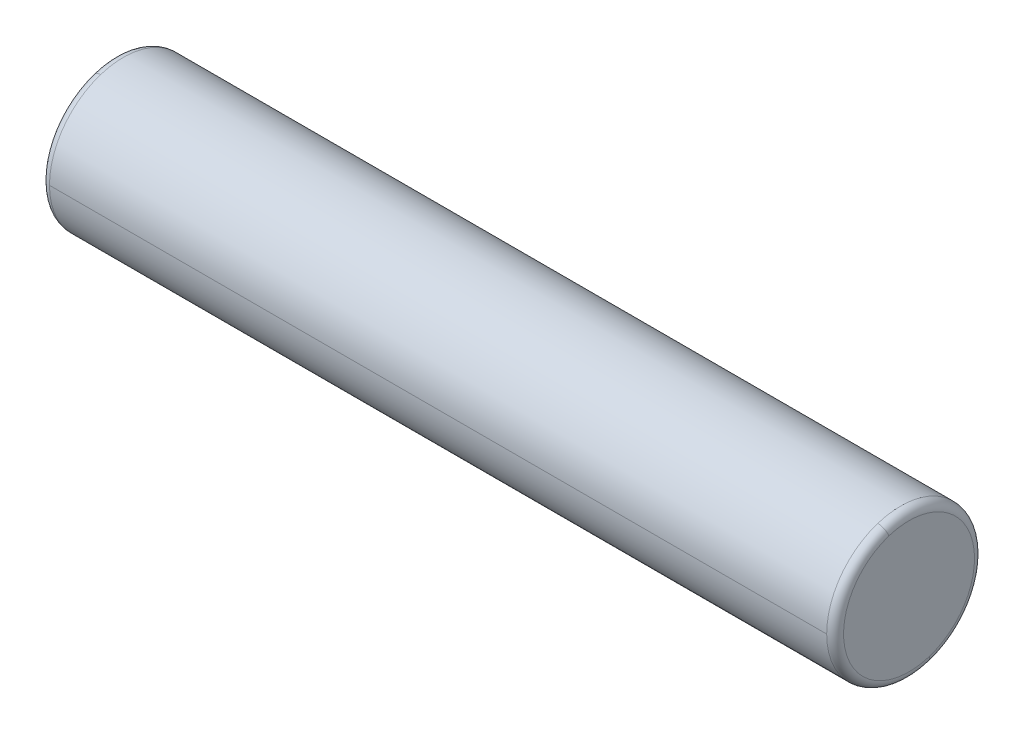
ISO-10303-21;
HEADER;
FILE_DESCRIPTION(('STEP AP214'),'2;1');
FILE_NAME('part.step','',(''),(''),'','','');
FILE_SCHEMA(('AUTOMOTIVE_DESIGN { 1 0 10303 214 1 1 1 1 }'));
ENDSEC;
DATA;
#1=APPLICATION_CONTEXT('core data for automotive mechanical design processes');
#2=APPLICATION_PROTOCOL_DEFINITION('international standard','automotive_design',2000,#1);
#3=PRODUCT_CONTEXT('',#1,'mechanical');
#4=PRODUCT('Part','Part','',(#3));
#5=PRODUCT_RELATED_PRODUCT_CATEGORY('part','',(#4));
#6=PRODUCT_DEFINITION_FORMATION('','',#4);
#7=PRODUCT_DEFINITION_CONTEXT('part definition',#1,'design');
#8=PRODUCT_DEFINITION('design','',#6,#7);
#9=PRODUCT_DEFINITION_SHAPE('','',#8);
#10=(LENGTH_UNIT() NAMED_UNIT(*) SI_UNIT(.MILLI.,.METRE.));
#11=(NAMED_UNIT(*) PLANE_ANGLE_UNIT() SI_UNIT($,.RADIAN.));
#12=(NAMED_UNIT(*) SI_UNIT($,.STERADIAN.) SOLID_ANGLE_UNIT());
#13=UNCERTAINTY_MEASURE_WITH_UNIT(LENGTH_MEASURE(1.E-05),#10,'distance_accuracy_value','');
#14=(GEOMETRIC_REPRESENTATION_CONTEXT(3) GLOBAL_UNCERTAINTY_ASSIGNED_CONTEXT((#13)) GLOBAL_UNIT_ASSIGNED_CONTEXT((#10,
#11,#12)) REPRESENTATION_CONTEXT('',''));
#15=CARTESIAN_POINT('',(0.,0.,0.));
#16=DIRECTION('',(0.,0.,1.));
#17=DIRECTION('',(1.,0.,0.));
#18=AXIS2_PLACEMENT_3D('',#15,#16,#17);
#19=CARTESIAN_POINT('',(3.1,29.25,0.));
#20=DIRECTION('',(1.,0.,0.));
#21=DIRECTION('',(0.,0.,-1.));
#22=AXIS2_PLACEMENT_3D('',#19,#20,#21);
#23=PLANE('',#22);
#24=CARTESIAN_POINT('',(3.1,30.724137600257,0.478976341281001));
#25=CARTESIAN_POINT('',(3.1,30.7163008719419,0.503097051966079));
#26=CARTESIAN_POINT('',(3.1,30.7078711460442,0.527025037923453));
#27=CARTESIAN_POINT('',(3.1,30.6898482176225,0.574438756045452));
#28=CARTESIAN_POINT('',(3.1,30.6802550150986,0.597924488210076));
#29=CARTESIAN_POINT('',(3.1,30.6599276519636,0.644396894409227));
#30=CARTESIAN_POINT('',(3.1,30.6491934913525,0.667383568443754));
#31=CARTESIAN_POINT('',(3.1,30.6266102302895,0.712802541800716));
#32=CARTESIAN_POINT('',(3.1,30.6147611298377,0.735234841123151));
#33=CARTESIAN_POINT('',(3.1,30.589976492087,0.779491007516879));
#34=CARTESIAN_POINT('',(3.1,30.5770409547882,0.801314874588172));
#35=CARTESIAN_POINT('',(3.1,30.550114617581,0.844301605203733));
#36=CARTESIAN_POINT('',(3.1,30.5361238176727,0.865464468748));
#37=CARTESIAN_POINT('',(3.1,30.5071206572556,0.907078207956979));
#38=CARTESIAN_POINT('',(3.1,30.4921082967468,0.92752908362169));
#39=CARTESIAN_POINT('',(3.1,30.4610981820384,0.967669579431778));
#40=CARTESIAN_POINT('',(3.1,30.4451004278388,0.987359199577156));
#41=CARTESIAN_POINT('',(3.1,30.4121580655205,1.02592975024571));
#42=CARTESIAN_POINT('',(3.1,30.3952134574019,1.04481068076889));
#43=CARTESIAN_POINT('',(3.1,30.3604182083495,1.08171836639997));
#44=CARTESIAN_POINT('',(3.1,30.3425675674158,1.09974512150787));
#45=CARTESIAN_POINT('',(3.1,30.306003256475,1.1349010282704));
#46=CARTESIAN_POINT('',(3.1,30.2872895864679,1.15203017992503));
#47=CARTESIAN_POINT('',(3.1,30.2490443002548,1.18534961415595));
#48=CARTESIAN_POINT('',(3.1,30.2295126840488,1.20153989673224));
#49=CARTESIAN_POINT('',(3.1,30.189678558811,1.23294258899722));
#50=CARTESIAN_POINT('',(3.1,30.1693760497791,1.24815499868591));
#51=CARTESIAN_POINT('',(3.1,30.1280490494124,1.27756529714842));
#52=CARTESIAN_POINT('',(3.1,30.1070245580776,1.29176318592224));
#53=CARTESIAN_POINT('',(3.1,30.0643042429459,1.31911023859733));
#54=CARTESIAN_POINT('',(3.1,30.0426084191492,1.33225940249861));
#55=CARTESIAN_POINT('',(3.1,29.9985977062335,1.35747732794104));
#56=CARTESIAN_POINT('',(3.1,29.9762828171147,1.36954608948221));
#57=CARTESIAN_POINT('',(3.1,29.9310877320774,1.39257413550077));
#58=CARTESIAN_POINT('',(3.1,29.908207536159,1.40353341997817));
#59=CARTESIAN_POINT('',(3.1,29.8619369579185,1.42431610999299));
#60=CARTESIAN_POINT('',(3.1,29.8385465755964,1.4341395155304));
#61=CARTESIAN_POINT('',(3.1,29.7913119740285,1.45262678222088));
#62=CARTESIAN_POINT('',(3.1,29.7674677547827,1.46129064337394));
#63=CARTESIAN_POINT('',(3.1,29.7193829221799,1.47743794929532));
#64=CARTESIAN_POINT('',(3.1,29.6951423088229,1.48492139406364));
#65=CARTESIAN_POINT('',(3.1,29.6463230857586,1.49868983894163));
#66=CARTESIAN_POINT('',(3.1,29.6217444760512,1.50497483905129));
#67=CARTESIAN_POINT('',(3.1,29.5723084723099,1.5163312534962));
#68=CARTESIAN_POINT('',(3.1,29.5474510782758,1.52140266783144));
#69=CARTESIAN_POINT('',(3.1,29.4975173895205,1.53031969324616));
#70=CARTESIAN_POINT('',(3.1,29.4724410947992,1.53416530432564));
#71=CARTESIAN_POINT('',(3.1,29.4221300156598,1.54062145881492));
#72=CARTESIAN_POINT('',(3.1,29.3968952312417,1.54323200222472));
#73=CARTESIAN_POINT('',(3.1,29.3463279655146,1.5472117323469));
#74=CARTESIAN_POINT('',(3.1,29.3209954842056,1.54858091905928));
#75=CARTESIAN_POINT('',(3.1,29.2702938528631,1.55007463729591));
#76=CARTESIAN_POINT('',(3.1,29.2449247028296,1.55019916882015));
#77=CARTESIAN_POINT('',(3.1,29.1942108505425,1.54920327667317));
#78=CARTESIAN_POINT('',(3.1,29.168866148289,1.54808285300193));
#79=CARTESIAN_POINT('',(3.1,29.1182622491695,1.54459974966274));
#80=CARTESIAN_POINT('',(3.1,29.0930030523037,1.54223706999478));
#81=CARTESIAN_POINT('',(3.1,29.0426310155772,1.53627514656442));
#82=CARTESIAN_POINT('',(3.1,29.0175181757166,1.532675902802));
#83=CARTESIAN_POINT('',(3.1,28.9674993520317,1.52424952207621));
#84=CARTESIAN_POINT('',(3.1,28.9425933682073,1.51942238511282));
#85=CARTESIAN_POINT('',(3.1,28.8930482572913,1.50855184698083));
#86=CARTESIAN_POINT('',(3.1,28.8684091301996,1.50250844581222));
#87=CARTESIAN_POINT('',(3.1,28.8194570905643,1.48921993835254));
#88=CARTESIAN_POINT('',(3.1,28.7951441780207,1.48197483206146));
#89=CARTESIAN_POINT('',(3.1,28.7469031394173,1.46630036845249));
#90=CARTESIAN_POINT('',(3.1,28.7229750133576,1.4578710111346));
#91=CARTESIAN_POINT('',(3.1,28.6755611926735,1.4398483525321));
#92=CARTESIAN_POINT('',(3.1,28.6520754980492,1.43025505124749));
#93=CARTESIAN_POINT('',(3.1,28.6056031193315,1.40992761581464));
#94=CARTESIAN_POINT('',(3.1,28.5826164352381,1.39919348166639));
#95=CARTESIAN_POINT('',(3.1,28.5371974545175,1.37661023997561));
#96=CARTESIAN_POINT('',(3.1,28.5147651578903,1.36476113243307));
#97=CARTESIAN_POINT('',(3.1,28.4705089934697,1.33997648949166));
#98=CARTESIAN_POINT('',(3.1,28.4486851256762,1.32704095409277));
#99=CARTESIAN_POINT('',(3.1,28.4056983945319,1.30011461827644));
#100=CARTESIAN_POINT('',(3.1,28.3845355311812,1.286123817859));
#101=CARTESIAN_POINT('',(3.1,28.3429217921139,1.25712065706921));
#102=CARTESIAN_POINT('',(3.1,28.3224709163973,1.24210829669686));
#103=CARTESIAN_POINT('',(3.1,28.2823304205492,1.21109818208833));
#104=CARTESIAN_POINT('',(3.1,28.2626408004178,1.19510042785215));
#105=CARTESIAN_POINT('',(3.1,28.2240702497594,1.16215806550713));
#106=CARTESIAN_POINT('',(3.1,28.2051893192325,1.1452134573983));
#107=CARTESIAN_POINT('',(3.1,28.1682816335987,1.1104182083531));
#108=CARTESIAN_POINT('',(3.1,28.1502548784918,1.09256756741673));
#109=CARTESIAN_POINT('',(3.1,28.11509897173,1.056003256474));
#110=CARTESIAN_POINT('',(3.1,28.0979698200751,1.03728958646764));
#111=CARTESIAN_POINT('',(3.1,28.064650385844,0.999044300255088));
#112=CARTESIAN_POINT('',(3.1,28.0484601032677,0.979512684048904));
#113=CARTESIAN_POINT('',(3.1,28.0170574110028,0.939678558810919));
#114=CARTESIAN_POINT('',(3.1,28.0018450013141,0.919376049779119));
#115=CARTESIAN_POINT('',(3.1,27.9724347028516,0.878049049412452));
#116=CARTESIAN_POINT('',(3.1,27.9582368140778,0.857024558077586));
#117=CARTESIAN_POINT('',(3.1,27.9308897614027,0.814304242945939));
#118=CARTESIAN_POINT('',(3.1,27.9177405975014,0.792608419149159));
#119=CARTESIAN_POINT('',(3.1,27.892522672059,0.748597706233541));
#120=CARTESIAN_POINT('',(3.1,27.8804539105178,0.726282817114703));
#121=CARTESIAN_POINT('',(3.1,27.8574258644992,0.68108773207741));
#122=CARTESIAN_POINT('',(3.1,27.8464665800218,0.658207536158955));
#123=CARTESIAN_POINT('',(3.1,27.825683890007,0.611936957918464));
#124=CARTESIAN_POINT('',(3.1,27.8158604844696,0.588546575596428));
#125=CARTESIAN_POINT('',(3.1,27.7973732177791,0.541311974028549));
#126=CARTESIAN_POINT('',(3.1,27.7887093566261,0.517467754782707));
#127=CARTESIAN_POINT('',(3.1,27.7725620507047,0.469382922179862));
#128=CARTESIAN_POINT('',(3.1,27.7650786059363,0.44514230882286));
#129=CARTESIAN_POINT('',(3.1,27.7513101610584,0.396323085758586));
#130=CARTESIAN_POINT('',(3.1,27.745025160949,0.371744476051314));
#131=CARTESIAN_POINT('',(3.1,27.7336687465035,0.322308472309799));
#132=CARTESIAN_POINT('',(3.1,27.7285973321676,0.297451078275557));
#133=CARTESIAN_POINT('',(3.1,27.7196803067548,0.247517389520762));
#134=CARTESIAN_POINT('',(3.1,27.7158346956781,0.222441094800211));
#135=CARTESIAN_POINT('',(3.1,27.7093785411814,0.172130015658794));
#136=CARTESIAN_POINT('',(3.1,27.7067679977615,0.146895231237927));
#137=CARTESIAN_POINT('',(3.1,27.7027882676669,0.0963279655183182));
#138=CARTESIAN_POINT('',(3.1,27.7014190809923,0.0709954842195761));
#139=CARTESIAN_POINT('',(3.1,27.6999253626525,0.0202938528490886));
#140=CARTESIAN_POINT('',(3.1,27.6998008309875,-0.00507529722265686));
#141=CARTESIAN_POINT('',(3.1,27.7007967235192,-0.0557891494052583));
#142=CARTESIAN_POINT('',(3.1,27.7019171477161,-0.0811338515161143));
#143=CARTESIAN_POINT('',(3.1,27.7054002496193,-0.131737751025358));
#144=CARTESIAN_POINT('',(3.1,27.7077629273256,-0.156996948423746));
#145=CARTESIAN_POINT('',(3.1,27.7137248561152,-0.207368983695411));
#146=CARTESIAN_POINT('',(3.1,27.7173241071983,-0.232481821568688));
#147=CARTESIAN_POINT('',(3.1,27.7257504679235,-0.282500650682992));
#148=CARTESIAN_POINT('',(3.1,27.7305775775655,-0.30740664192402));
#149=CARTESIAN_POINT('',(3.1,27.7414481903408,-0.356951732577393));
#150=CARTESIAN_POINT('',(3.1,27.7474916934742,-0.381590831989738));
#151=CARTESIAN_POINT('',(3.1,27.7607799223611,-0.430542947246312));
#152=CARTESIAN_POINT('',(3.1,27.7680246481147,-0.454855963090541));
#153=CARTESIAN_POINT('',(3.1,27.775862399743,-0.478976341280996));
#154=B_SPLINE_CURVE_WITH_KNOTS('',3,(#24,#25,#26,#27,#28,#29,#30,#31,#32,#33,#34,#35,#36,#37,
#38,#39,#40,#41,#42,#43,#44,#45,#46,#47,#48,#49,#50,#51,#52,#53,#54,#55,#56,#57,#58,#59,#60,#61,
#62,#63,#64,#65,#66,#67,#68,#69,#70,#71,#72,#73,#74,#75,#76,#77,#78,#79,#80,#81,#82,#83,#84,#85,
#86,#87,#88,#89,#90,#91,#92,#93,#94,#95,#96,#97,#98,#99,#100,#101,#102,#103,#104,#105,#106,#107,
#108,#109,#110,#111,#112,#113,#114,#115,#116,#117,#118,#119,#120,#121,#122,#123,#124,#125,#126,
#127,#128,#129,#130,#131,#132,#133,#134,#135,#136,#137,#138,#139,#140,#141,#142,#143,#144,#145,
#146,#147,#148,#149,#150,#151,#152,#153),.UNSPECIFIED.,.F.,.F.,(4,2,2,2,2,2,2,2,2,2,2,2,2,2,2,2,
2,2,2,2,2,2,2,2,2,2,2,2,2,2,2,2,2,2,2,2,2,2,2,2,2,2,2,2,2,2,2,2,2,2,2,2,2,2,2,2,2,2,2,2,2,2,2,2,
4),(0.,0.0760778084210016,0.152155616842003,0.228233425263003,0.304311233684006,
0.380389042105006,0.456466850526008,0.53254465894701,0.608622467368011,0.684700275789012,
0.760778084210015,0.836855892631017,0.912933701052018,0.989011509473018,1.06508931789402,
1.14116712631502,1.21724493473602,1.29332274315702,1.36940055157803,1.44547835999903,
1.52155616842003,1.59763397684103,1.67371178526203,1.74978959368303,1.82586740210404,
1.90194521052504,1.97802301894604,2.05410082736704,2.13017863578804,2.20625644420904,
2.28233425263004,2.35841206105104,2.43448986947205,2.51056767789305,2.58664548631405,
2.66272329473505,2.73880110315605,2.81487891157705,2.89095671999805,2.96703452841906,
3.04311233684006,3.11919014526106,3.19526795368206,3.27134576210306,3.34742357052406,
3.42350137894507,3.49957918736607,3.57565699578707,3.65173480420807,3.72781261262907,
3.80389042105007,3.87996822947107,3.95604603789208,4.03212384631308,4.10820165473408,
4.18427946315508,4.26035727157608,4.33643507999708,4.41251288841808,4.48859069683909,
4.56466850526009,4.64074631368109,4.71682412210209,4.79290193052309,4.86897973894409),.UNSPECIFIED.);
#155=CARTESIAN_POINT('',(3.1,30.724137600257,0.478976341281001));
#156=VERTEX_POINT('',#155);
#157=CARTESIAN_POINT('',(3.1,27.775862399743,-0.478976341281001));
#158=VERTEX_POINT('',#157);
#159=EDGE_CURVE('E11',#156,#158,#154,.T.);
#160=ORIENTED_EDGE('',*,*,#159,.F.);
#161=CARTESIAN_POINT('',(3.1,27.775862399743,-0.478976341281001));
#162=CARTESIAN_POINT('',(3.1,27.7836991280581,-0.503097051966078));
#163=CARTESIAN_POINT('',(3.1,27.7921288539558,-0.527025037923453));
#164=CARTESIAN_POINT('',(3.1,27.8101517823775,-0.574438756045452));
#165=CARTESIAN_POINT('',(3.1,27.8197449849014,-0.597924488210076));
#166=CARTESIAN_POINT('',(3.1,27.8400723480365,-0.644396894409227));
#167=CARTESIAN_POINT('',(3.1,27.8508065086475,-0.667383568443754));
#168=CARTESIAN_POINT('',(3.1,27.8733897697105,-0.712802541800716));
#169=CARTESIAN_POINT('',(3.1,27.8852388701623,-0.735234841123151));
#170=CARTESIAN_POINT('',(3.1,27.910023507913,-0.779491007516879));
#171=CARTESIAN_POINT('',(3.1,27.9229590452118,-0.801314874588172));
#172=CARTESIAN_POINT('',(3.1,27.949885382419,-0.844301605203732));
#173=CARTESIAN_POINT('',(3.1,27.9638761823273,-0.865464468748));
#174=CARTESIAN_POINT('',(3.1,27.9928793427445,-0.907078207956979));
#175=CARTESIAN_POINT('',(3.1,28.0078917032532,-0.92752908362169));
#176=CARTESIAN_POINT('',(3.1,28.0389018179616,-0.967669579431778));
#177=CARTESIAN_POINT('',(3.1,28.0548995721612,-0.987359199577155));
#178=CARTESIAN_POINT('',(3.1,28.0878419344795,-1.02592975024571));
#179=CARTESIAN_POINT('',(3.1,28.1047865425981,-1.04481068076889));
#180=CARTESIAN_POINT('',(3.1,28.1395817916505,-1.08171836639997));
#181=CARTESIAN_POINT('',(3.1,28.1574324325842,-1.09974512150787));
#182=CARTESIAN_POINT('',(3.1,28.193996743525,-1.1349010282704));
#183=CARTESIAN_POINT('',(3.1,28.2127104135321,-1.15203017992503));
#184=CARTESIAN_POINT('',(3.1,28.2509556997452,-1.18534961415595));
#185=CARTESIAN_POINT('',(3.1,28.2704873159512,-1.20153989673224));
#186=CARTESIAN_POINT('',(3.1,28.310321441189,-1.23294258899722));
#187=CARTESIAN_POINT('',(3.1,28.3306239502209,-1.24815499868591));
#188=CARTESIAN_POINT('',(3.1,28.3719509505876,-1.27756529714842));
#189=CARTESIAN_POINT('',(3.1,28.3929754419224,-1.29176318592224));
#190=CARTESIAN_POINT('',(3.1,28.4356957570541,-1.31911023859733));
#191=CARTESIAN_POINT('',(3.1,28.4573915808508,-1.33225940249861));
#192=CARTESIAN_POINT('',(3.1,28.5014022937665,-1.35747732794104));
#193=CARTESIAN_POINT('',(3.1,28.5237171828853,-1.3695460894822));
#194=CARTESIAN_POINT('',(3.1,28.5689122679226,-1.39257413550077));
#195=CARTESIAN_POINT('',(3.1,28.591792463841,-1.40353341997817));
#196=CARTESIAN_POINT('',(3.1,28.6380630420815,-1.42431610999299));
#197=CARTESIAN_POINT('',(3.1,28.6614534244036,-1.4341395155304));
#198=CARTESIAN_POINT('',(3.1,28.7086880259715,-1.45262678222088));
#199=CARTESIAN_POINT('',(3.1,28.7325322452173,-1.46129064337394));
#200=CARTESIAN_POINT('',(3.1,28.7806170778201,-1.47743794929532));
#201=CARTESIAN_POINT('',(3.1,28.8048576911771,-1.48492139406364));
#202=CARTESIAN_POINT('',(3.1,28.8536769142414,-1.49868983894162));
#203=CARTESIAN_POINT('',(3.1,28.8782555239488,-1.50497483905129));
#204=CARTESIAN_POINT('',(3.1,28.9276915276901,-1.5163312534962));
#205=CARTESIAN_POINT('',(3.1,28.9525489217242,-1.52140266783144));
#206=CARTESIAN_POINT('',(3.1,29.0024826104795,-1.53031969324616));
#207=CARTESIAN_POINT('',(3.1,29.0275589052008,-1.53416530432564));
#208=CARTESIAN_POINT('',(3.1,29.0778699843402,-1.54062145881492));
#209=CARTESIAN_POINT('',(3.1,29.1031047687583,-1.54323200222472));
#210=CARTESIAN_POINT('',(3.1,29.1536720344854,-1.5472117323469));
#211=CARTESIAN_POINT('',(3.1,29.1790045157944,-1.54858091905928));
#212=CARTESIAN_POINT('',(3.1,29.2297061471369,-1.55007463729591));
#213=CARTESIAN_POINT('',(3.1,29.2550752971704,-1.55019916882015));
#214=CARTESIAN_POINT('',(3.1,29.3057891494575,-1.54920327667317));
#215=CARTESIAN_POINT('',(3.1,29.331133851711,-1.54808285300193));
#216=CARTESIAN_POINT('',(3.1,29.3817377508305,-1.54459974966274));
#217=CARTESIAN_POINT('',(3.1,29.4069969476964,-1.54223706999478));
#218=CARTESIAN_POINT('',(3.1,29.4573689844228,-1.53627514656442));
#219=CARTESIAN_POINT('',(3.1,29.4824818242834,-1.532675902802));
#220=CARTESIAN_POINT('',(3.1,29.5325006479683,-1.52424952207621));
#221=CARTESIAN_POINT('',(3.1,29.5574066317927,-1.51942238511282));
#222=CARTESIAN_POINT('',(3.1,29.6069517427087,-1.50855184698083));
#223=CARTESIAN_POINT('',(3.1,29.6315908698004,-1.50250844581222));
#224=CARTESIAN_POINT('',(3.1,29.6805429094357,-1.48921993835254));
#225=CARTESIAN_POINT('',(3.1,29.7048558219793,-1.48197483206146));
#226=CARTESIAN_POINT('',(3.1,29.7530968605827,-1.46630036845249));
#227=CARTESIAN_POINT('',(3.1,29.7770249866424,-1.4578710111346));
#228=CARTESIAN_POINT('',(3.1,29.8244388073265,-1.4398483525321));
#229=CARTESIAN_POINT('',(3.1,29.8479245019508,-1.43025505124749));
#230=CARTESIAN_POINT('',(3.1,29.8943968806685,-1.40992761581464));
#231=CARTESIAN_POINT('',(3.1,29.9173835647619,-1.39919348166639));
#232=CARTESIAN_POINT('',(3.1,29.9628025454825,-1.37661023997561));
#233=CARTESIAN_POINT('',(3.1,29.9852348421097,-1.36476113243307));
#234=CARTESIAN_POINT('',(3.1,30.0294910065303,-1.33997648949166));
#235=CARTESIAN_POINT('',(3.1,30.0513148743238,-1.32704095409277));
#236=CARTESIAN_POINT('',(3.1,30.0943016054681,-1.30011461827644));
#237=CARTESIAN_POINT('',(3.1,30.1154644688188,-1.286123817859));
#238=CARTESIAN_POINT('',(3.1,30.1570782078861,-1.25712065706921));
#239=CARTESIAN_POINT('',(3.1,30.1775290836027,-1.24210829669686));
#240=CARTESIAN_POINT('',(3.1,30.2176695794508,-1.21109818208833));
#241=CARTESIAN_POINT('',(3.1,30.2373591995822,-1.19510042785215));
#242=CARTESIAN_POINT('',(3.1,30.2759297502406,-1.16215806550713));
#243=CARTESIAN_POINT('',(3.1,30.2948106807675,-1.1452134573983));
#244=CARTESIAN_POINT('',(3.1,30.3317183664013,-1.1104182083531));
#245=CARTESIAN_POINT('',(3.1,30.3497451215082,-1.09256756741673));
#246=CARTESIAN_POINT('',(3.1,30.38490102827,-1.056003256474));
#247=CARTESIAN_POINT('',(3.1,30.4020301799249,-1.03728958646764));
#248=CARTESIAN_POINT('',(3.1,30.435349614156,-0.99904430025509));
#249=CARTESIAN_POINT('',(3.1,30.4515398967323,-0.979512684048905));
#250=CARTESIAN_POINT('',(3.1,30.4829425889972,-0.93967855881092));
#251=CARTESIAN_POINT('',(3.1,30.4981549986859,-0.919376049779121));
#252=CARTESIAN_POINT('',(3.1,30.5275652971484,-0.878049049412455));
#253=CARTESIAN_POINT('',(3.1,30.5417631859222,-0.857024558077588));
#254=CARTESIAN_POINT('',(3.1,30.5691102385973,-0.814304242945941));
#255=CARTESIAN_POINT('',(3.1,30.5822594024986,-0.792608419149161));
#256=CARTESIAN_POINT('',(3.1,30.607477327941,-0.748597706233543));
#257=CARTESIAN_POINT('',(3.1,30.6195460894822,-0.726282817114704));
#258=CARTESIAN_POINT('',(3.1,30.6425741355008,-0.681087732077411));
#259=CARTESIAN_POINT('',(3.1,30.6535334199782,-0.658207536158957));
#260=CARTESIAN_POINT('',(3.1,30.674316109993,-0.611936957918467));
#261=CARTESIAN_POINT('',(3.1,30.6841395155304,-0.58854657559643));
#262=CARTESIAN_POINT('',(3.1,30.7026267822209,-0.541311974028552));
#263=CARTESIAN_POINT('',(3.1,30.7112906433739,-0.517467754782709));
#264=CARTESIAN_POINT('',(3.1,30.7274379492953,-0.469382922179864));
#265=CARTESIAN_POINT('',(3.1,30.7349213940637,-0.445142308822862));
#266=CARTESIAN_POINT('',(3.1,30.7486898389416,-0.396323085758588));
#267=CARTESIAN_POINT('',(3.1,30.754974839051,-0.371744476051316));
#268=CARTESIAN_POINT('',(3.1,30.7663312534965,-0.322308472309802));
#269=CARTESIAN_POINT('',(3.1,30.7714026678324,-0.297451078275559));
#270=CARTESIAN_POINT('',(3.1,30.7803196932452,-0.247517389520765));
#271=CARTESIAN_POINT('',(3.1,30.7841653043219,-0.222441094800213));
#272=CARTESIAN_POINT('',(3.1,30.7906214588186,-0.172130015658796));
#273=CARTESIAN_POINT('',(3.1,30.7932320022385,-0.146895231237929));
#274=CARTESIAN_POINT('',(3.1,30.7972117323331,-0.0963279655183212));
#275=CARTESIAN_POINT('',(3.1,30.7985809190077,-0.0709954842195791));
#276=CARTESIAN_POINT('',(3.1,30.8000746373475,-0.0202938528490916));
#277=CARTESIAN_POINT('',(3.1,30.8001991690125,0.00507529722265386));
#278=CARTESIAN_POINT('',(3.1,30.7992032764808,0.0557891494052553));
#279=CARTESIAN_POINT('',(3.1,30.7980828522839,0.0811338515161114));
#280=CARTESIAN_POINT('',(3.1,30.7945997503807,0.131737751025355));
#281=CARTESIAN_POINT('',(3.1,30.7922370726744,0.156996948423743));
#282=CARTESIAN_POINT('',(3.1,30.7862751438848,0.207368983695409));
#283=CARTESIAN_POINT('',(3.1,30.7826758928017,0.232481821568686));
#284=CARTESIAN_POINT('',(3.1,30.7742495320765,0.282500650682991));
#285=CARTESIAN_POINT('',(3.1,30.7694224224345,0.307406641924018));
#286=CARTESIAN_POINT('',(3.1,30.7585518096592,0.356951732577391));
#287=CARTESIAN_POINT('',(3.1,30.7525083065258,0.381590831989736));
#288=CARTESIAN_POINT('',(3.1,30.7392200776389,0.43054294724631));
#289=CARTESIAN_POINT('',(3.1,30.7319753518853,0.454855963090539));
#290=CARTESIAN_POINT('',(3.1,30.724137600257,0.478976341280993));
#291=B_SPLINE_CURVE_WITH_KNOTS('',3,(#161,#162,#163,#164,#165,#166,#167,#168,#169,#170,#171,
#172,#173,#174,#175,#176,#177,#178,#179,#180,#181,#182,#183,#184,#185,#186,#187,#188,#189,#190,
#191,#192,#193,#194,#195,#196,#197,#198,#199,#200,#201,#202,#203,#204,#205,#206,#207,#208,#209,
#210,#211,#212,#213,#214,#215,#216,#217,#218,#219,#220,#221,#222,#223,#224,#225,#226,#227,#228,
#229,#230,#231,#232,#233,#234,#235,#236,#237,#238,#239,#240,#241,#242,#243,#244,#245,#246,#247,
#248,#249,#250,#251,#252,#253,#254,#255,#256,#257,#258,#259,#260,#261,#262,#263,#264,#265,#266,
#267,#268,#269,#270,#271,#272,#273,#274,#275,#276,#277,#278,#279,#280,#281,#282,#283,#284,#285,
#286,#287,#288,#289,#290),.UNSPECIFIED.,.F.,.F.,(4,2,2,2,2,2,2,2,2,2,2,2,2,2,2,2,2,2,2,2,2,2,2,
2,2,2,2,2,2,2,2,2,2,2,2,2,2,2,2,2,2,2,2,2,2,2,2,2,2,2,2,2,2,2,2,2,2,2,2,2,2,2,2,2,4),(0.,
0.0760778084210017,0.152155616842002,0.228233425263003,0.304311233684006,0.380389042105006,
0.456466850526008,0.53254465894701,0.60862246736801,0.684700275789012,0.760778084210015,
0.836855892631014,0.912933701052015,0.989011509473018,1.06508931789402,1.14116712631502,
1.21724493473602,1.29332274315702,1.36940055157803,1.44547835999903,1.52155616842003,
1.59763397684103,1.67371178526203,1.74978959368303,1.82586740210403,1.90194521052504,
1.97802301894604,2.05410082736704,2.13017863578804,2.20625644420904,2.28233425263004,
2.35841206105105,2.43448986947204,2.51056767789305,2.58664548631405,2.66272329473505,
2.73880110315605,2.81487891157705,2.89095671999806,2.96703452841906,3.04311233684006,
3.11919014526106,3.19526795368206,3.27134576210306,3.34742357052406,3.42350137894507,
3.49957918736607,3.57565699578707,3.65173480420807,3.72781261262907,3.80389042105007,
3.87996822947107,3.95604603789207,4.03212384631308,4.10820165473408,4.18427946315508,
4.26035727157608,4.33643507999708,4.41251288841808,4.48859069683908,4.56466850526008,
4.64074631368109,4.71682412210209,4.79290193052309,4.86897973894409),.UNSPECIFIED.);
#292=EDGE_CURVE('E26',#158,#156,#291,.T.);
#293=ORIENTED_EDGE('',*,*,#292,.F.);
#294=EDGE_LOOP('',(#160,#293));
#295=FACE_BOUND('',#294,.T.);
#296=ADVANCED_FACE('F17',(#295),#23,.F.);
#297=CARTESIAN_POINT('',(3.30000000000054,29.25,0.));
#298=DIRECTION('',(1.,0.,0.));
#299=DIRECTION('',(0.,-0.309016994374947,0.951056516295154));
#300=AXIS2_PLACEMENT_3D('',#297,#298,#299);
#301=TOROIDAL_SURFACE('',#300,1.54999999999946,0.200000000000541);
#302=CARTESIAN_POINT('',(3.30000000000054,27.775862399743,-0.478976341281001));
#303=DIRECTION('',(0.,0.309016994374946,-0.951056516295154));
#304=DIRECTION('',(-2.70228284193032E-12,-0.951056516295154,-0.309016994374946));
#305=AXIS2_PLACEMENT_3D('',#302,#303,#304);
#306=CIRCLE('',#305,0.200000000000541);
#307=CARTESIAN_POINT('',(3.3,27.5856510964835,-0.540779740156158));
#308=VERTEX_POINT('',#307);
#309=EDGE_CURVE('E139',#308,#158,#306,.T.);
#310=ORIENTED_EDGE('',*,*,#309,.T.);
#311=ORIENTED_EDGE('',*,*,#292,.T.);
#312=CARTESIAN_POINT('',(3.30000000000054,30.724137600257,0.478976341281002));
#313=DIRECTION('',(0.,-0.309016994374946,0.951056516295154));
#314=DIRECTION('',(-2.70228284193032E-12,0.951056516295154,0.309016994374946));
#315=AXIS2_PLACEMENT_3D('',#312,#313,#314);
#316=CIRCLE('',#315,0.200000000000541);
#317=CARTESIAN_POINT('',(3.3,30.9143489035165,0.540779740156158));
#318=VERTEX_POINT('',#317);
#319=EDGE_CURVE('E135',#318,#156,#316,.T.);
#320=ORIENTED_EDGE('',*,*,#319,.F.);
#321=CARTESIAN_POINT('',(3.3,29.25,0.));
#322=DIRECTION('',(1.,0.,0.));
#323=DIRECTION('',(0.,0.,-1.));
#324=AXIS2_PLACEMENT_3D('',#321,#322,#323);
#325=CIRCLE('',#324,1.75);
#326=CARTESIAN_POINT('',(3.3,29.25,-1.75));
#327=VERTEX_POINT('',#326);
#328=EDGE_CURVE('E130',#327,#318,#325,.T.);
#329=ORIENTED_EDGE('',*,*,#328,.F.);
#330=CARTESIAN_POINT('',(3.3,29.25,0.));
#331=DIRECTION('',(1.,0.,0.));
#332=DIRECTION('',(0.,0.,-1.));
#333=AXIS2_PLACEMENT_3D('',#330,#331,#332);
#334=CIRCLE('',#333,1.75);
#335=EDGE_CURVE('E125',#308,#327,#334,.T.);
#336=ORIENTED_EDGE('',*,*,#335,.F.);
#337=EDGE_LOOP('',(#310,#311,#320,#329,#336));
#338=FACE_BOUND('',#337,.T.);
#339=ADVANCED_FACE('F146',(#338),#301,.T.);
#340=CARTESIAN_POINT('',(21.9,29.25,0.));
#341=DIRECTION('',(1.,0.,0.));
#342=DIRECTION('',(0.,1.,0.));
#343=AXIS2_PLACEMENT_3D('',#340,#341,#342);
#344=CYLINDRICAL_SURFACE('',#343,1.75);
#345=DIRECTION('',(1.,0.,0.));
#346=VECTOR('',#345,1.);
#347=CARTESIAN_POINT('',(3.3,29.25,1.75));
#348=LINE('',#347,#346);
#349=CARTESIAN_POINT('',(3.3,29.25,1.75));
#350=VERTEX_POINT('',#349);
#351=CARTESIAN_POINT('',(21.7,29.25,1.75));
#352=VERTEX_POINT('',#351);
#353=EDGE_CURVE('E92',#350,#352,#348,.T.);
#354=ORIENTED_EDGE('',*,*,#353,.F.);
#355=CARTESIAN_POINT('',(3.3,29.25,0.));
#356=DIRECTION('',(1.,0.,0.));
#357=DIRECTION('',(0.,0.,-1.));
#358=AXIS2_PLACEMENT_3D('',#355,#356,#357);
#359=CIRCLE('',#358,1.75);
#360=EDGE_CURVE('E117',#350,#308,#359,.T.);
#361=ORIENTED_EDGE('',*,*,#360,.T.);
#362=ORIENTED_EDGE('',*,*,#335,.T.);
#363=DIRECTION('',(1.,0.,0.));
#364=VECTOR('',#363,1.);
#365=CARTESIAN_POINT('',(3.3,29.25,-1.75));
#366=LINE('',#365,#364);
#367=CARTESIAN_POINT('',(21.7,29.25,-1.75));
#368=VERTEX_POINT('',#367);
#369=EDGE_CURVE('E113',#327,#368,#366,.T.);
#370=ORIENTED_EDGE('',*,*,#369,.T.);
#371=CARTESIAN_POINT('',(21.7,29.25,0.));
#372=DIRECTION('',(1.,0.,0.));
#373=DIRECTION('',(0.,0.,-1.));
#374=AXIS2_PLACEMENT_3D('',#371,#372,#373);
#375=CIRCLE('',#374,1.75);
#376=CARTESIAN_POINT('',(21.7,27.5856510964835,-0.540779740156158));
#377=VERTEX_POINT('',#376);
#378=EDGE_CURVE('E84',#377,#368,#375,.T.);
#379=ORIENTED_EDGE('',*,*,#378,.F.);
#380=CARTESIAN_POINT('',(21.7,29.25,0.));
#381=DIRECTION('',(1.,0.,0.));
#382=DIRECTION('',(0.,0.,-1.));
#383=AXIS2_PLACEMENT_3D('',#380,#381,#382);
#384=CIRCLE('',#383,1.75);
#385=EDGE_CURVE('E106',#352,#377,#384,.T.);
#386=ORIENTED_EDGE('',*,*,#385,.F.);
#387=EDGE_LOOP('',(#354,#361,#362,#370,#379,#386));
#388=FACE_BOUND('',#387,.T.);
#389=ADVANCED_FACE('F155',(#388),#344,.T.);
#390=CARTESIAN_POINT('',(21.6999999999989,29.25,0.));
#391=DIRECTION('',(1.,0.,0.));
#392=DIRECTION('',(0.,0.309016994374947,-0.951056516295154));
#393=AXIS2_PLACEMENT_3D('',#390,#391,#392);
#394=TOROIDAL_SURFACE('',#393,1.54999999999895,0.20000000000105);
#395=CARTESIAN_POINT('',(21.6999999999989,27.7758623997435,-0.478976341280844));
#396=DIRECTION('',(0.,0.309016994374947,-0.951056516295154));
#397=DIRECTION('',(1.,0.,0.));
#398=AXIS2_PLACEMENT_3D('',#395,#396,#397);
#399=CIRCLE('',#398,0.200000000001051);
#400=CARTESIAN_POINT('',(21.9,27.7758623997435,-0.478976341280844));
#401=VERTEX_POINT('',#400);
#402=EDGE_CURVE('E102',#401,#377,#399,.T.);
#403=ORIENTED_EDGE('',*,*,#402,.F.);
#404=CARTESIAN_POINT('',(21.9,29.25,0.));
#405=DIRECTION('',(1.,0.,0.));
#406=DIRECTION('',(0.,0.,-1.));
#407=AXIS2_PLACEMENT_3D('',#404,#405,#406);
#408=CIRCLE('',#407,1.55);
#409=CARTESIAN_POINT('',(21.9,30.7241376002565,0.478976341280844));
#410=VERTEX_POINT('',#409);
#411=EDGE_CURVE('E74',#410,#401,#408,.T.);
#412=ORIENTED_EDGE('',*,*,#411,.F.);
#413=CARTESIAN_POINT('',(21.6999999999989,30.7241376002565,0.478976341280844));
#414=DIRECTION('',(0.,-0.309016994374947,0.951056516295154));
#415=DIRECTION('',(1.,0.,0.));
#416=AXIS2_PLACEMENT_3D('',#413,#414,#415);
#417=CIRCLE('',#416,0.200000000001051);
#418=CARTESIAN_POINT('',(21.7,30.9143489035165,0.540779740156158));
#419=VERTEX_POINT('',#418);
#420=EDGE_CURVE('E67',#410,#419,#417,.T.);
#421=ORIENTED_EDGE('',*,*,#420,.T.);
#422=CARTESIAN_POINT('',(21.7,29.25,0.));
#423=DIRECTION('',(1.,0.,0.));
#424=DIRECTION('',(0.,0.,-1.));
#425=AXIS2_PLACEMENT_3D('',#422,#423,#424);
#426=CIRCLE('',#425,1.75);
#427=EDGE_CURVE('E72',#419,#352,#426,.T.);
#428=ORIENTED_EDGE('',*,*,#427,.T.);
#429=ORIENTED_EDGE('',*,*,#385,.T.);
#430=EDGE_LOOP('',(#403,#412,#421,#428,#429));
#431=FACE_BOUND('',#430,.T.);
#432=ADVANCED_FACE('F69',(#431),#394,.T.);
#433=CARTESIAN_POINT('',(21.9,29.25,0.));
#434=DIRECTION('',(1.,0.,0.));
#435=DIRECTION('',(0.,-1.,0.));
#436=AXIS2_PLACEMENT_3D('',#433,#434,#435);
#437=CYLINDRICAL_SURFACE('',#436,1.75);
#438=ORIENTED_EDGE('',*,*,#353,.T.);
#439=ORIENTED_EDGE('',*,*,#427,.F.);
#440=CARTESIAN_POINT('',(21.7,29.25,0.));
#441=DIRECTION('',(1.,0.,0.));
#442=DIRECTION('',(0.,0.,-1.));
#443=AXIS2_PLACEMENT_3D('',#440,#441,#442);
#444=CIRCLE('',#443,1.75);
#445=EDGE_CURVE('E81',#368,#419,#444,.T.);
#446=ORIENTED_EDGE('',*,*,#445,.F.);
#447=ORIENTED_EDGE('',*,*,#369,.F.);
#448=ORIENTED_EDGE('',*,*,#328,.T.);
#449=CARTESIAN_POINT('',(3.3,29.25,0.));
#450=DIRECTION('',(1.,0.,0.));
#451=DIRECTION('',(0.,0.,-1.));
#452=AXIS2_PLACEMENT_3D('',#449,#450,#451);
#453=CIRCLE('',#452,1.75);
#454=EDGE_CURVE('E87',#318,#350,#453,.T.);
#455=ORIENTED_EDGE('',*,*,#454,.T.);
#456=EDGE_LOOP('',(#438,#439,#446,#447,#448,#455));
#457=FACE_BOUND('',#456,.T.);
#458=ADVANCED_FACE('F90',(#457),#437,.T.);
#459=CARTESIAN_POINT('',(3.30000000000054,29.25,0.));
#460=DIRECTION('',(1.,0.,0.));
#461=DIRECTION('',(0.,0.309016994374947,-0.951056516295154));
#462=AXIS2_PLACEMENT_3D('',#459,#460,#461);
#463=TOROIDAL_SURFACE('',#462,1.54999999999946,0.200000000000541);
#464=ORIENTED_EDGE('',*,*,#309,.F.);
#465=ORIENTED_EDGE('',*,*,#360,.F.);
#466=ORIENTED_EDGE('',*,*,#454,.F.);
#467=ORIENTED_EDGE('',*,*,#319,.T.);
#468=ORIENTED_EDGE('',*,*,#159,.T.);
#469=EDGE_LOOP('',(#464,#465,#466,#467,#468));
#470=FACE_BOUND('',#469,.T.);
#471=ADVANCED_FACE('F164',(#470),#463,.T.);
#472=CARTESIAN_POINT('',(21.6999999999989,29.25,0.));
#473=DIRECTION('',(1.,0.,0.));
#474=DIRECTION('',(0.,-0.309016994374947,0.951056516295154));
#475=AXIS2_PLACEMENT_3D('',#472,#473,#474);
#476=TOROIDAL_SURFACE('',#475,1.54999999999895,0.20000000000105);
#477=ORIENTED_EDGE('',*,*,#402,.T.);
#478=ORIENTED_EDGE('',*,*,#378,.T.);
#479=ORIENTED_EDGE('',*,*,#445,.T.);
#480=ORIENTED_EDGE('',*,*,#420,.F.);
#481=CARTESIAN_POINT('',(21.9,27.7758623997425,-0.478976341281168));
#482=CARTESIAN_POINT('',(21.9,27.9264782974249,-0.941884387721592));
#483=CARTESIAN_POINT('',(21.9,28.2580658231372,-1.34696942542323));
#484=CARTESIAN_POINT('',(21.9,28.7436053927599,-1.59373420905432));
#485=CARTESIAN_POINT('',(21.9,29.7879223325458,-1.65555470715509));
#486=CARTESIAN_POINT('',(21.9,30.5964553072732,-0.991706777665464));
#487=CARTESIAN_POINT('',(21.9,30.844220369936,-0.506676875666024));
#488=CARTESIAN_POINT('',(21.9,30.8743773022746,0.0159460614594268));
#489=CARTESIAN_POINT('',(21.9,30.7241376002575,0.478976341281168));
#490=B_SPLINE_CURVE_WITH_KNOTS('',5,(#481,#482,#483,#484,#485,#486,#487,#488,#489),
.UNSPECIFIED.,.F.,.F.,(6,3,6),(0.,1.5707963267949,3.14159265358979),.UNSPECIFIED.);
#491=EDGE_CURVE('E185',#401,#410,#490,.T.);
#492=ORIENTED_EDGE('',*,*,#491,.F.);
#493=EDGE_LOOP('',(#477,#478,#479,#480,#492));
#494=FACE_BOUND('',#493,.T.);
#495=ADVANCED_FACE('F83',(#494),#476,.T.);
#496=CARTESIAN_POINT('',(21.9,30.8,0.));
#497=DIRECTION('',(-1.,0.,0.));
#498=DIRECTION('',(0.,0.,1.));
#499=AXIS2_PLACEMENT_3D('',#496,#497,#498);
#500=PLANE('',#499);
#501=ORIENTED_EDGE('',*,*,#491,.T.);
#502=ORIENTED_EDGE('',*,*,#411,.T.);
#503=EDGE_LOOP('',(#501,#502));
#504=FACE_BOUND('',#503,.T.);
#505=ADVANCED_FACE('F191',(#504),#500,.F.);
#506=CLOSED_SHELL('',(#296,#339,#389,#432,#458,#471,#495,#505));
#507=MANIFOLD_SOLID_BREP('B1',#506);
#508=ADVANCED_BREP_SHAPE_REPRESENTATION('',(#18,#507),#14);
#509=SHAPE_DEFINITION_REPRESENTATION(#9,#508);
ENDSEC;
END-ISO-10303-21;
